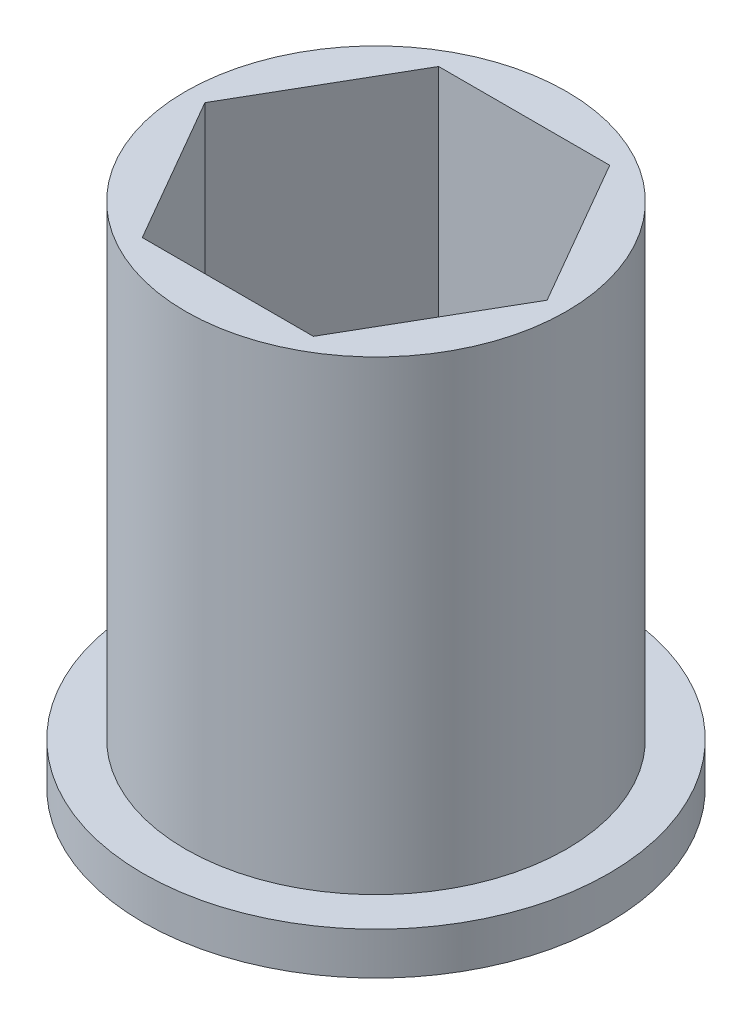
ISO-10303-21;
HEADER;
FILE_DESCRIPTION(('STEP AP214'),'2;1');
FILE_NAME('part.step','',(''),(''),'','','');
FILE_SCHEMA(('AUTOMOTIVE_DESIGN { 1 0 10303 214 1 1 1 1 }'));
ENDSEC;
DATA;
#1=APPLICATION_CONTEXT('core data for automotive mechanical design processes');
#2=APPLICATION_PROTOCOL_DEFINITION('international standard','automotive_design',2000,#1);
#3=PRODUCT_CONTEXT('',#1,'mechanical');
#4=PRODUCT('Part','Part','',(#3));
#5=PRODUCT_RELATED_PRODUCT_CATEGORY('part','',(#4));
#6=PRODUCT_DEFINITION_FORMATION('','',#4);
#7=PRODUCT_DEFINITION_CONTEXT('part definition',#1,'design');
#8=PRODUCT_DEFINITION('design','',#6,#7);
#9=PRODUCT_DEFINITION_SHAPE('','',#8);
#10=(LENGTH_UNIT() NAMED_UNIT(*) SI_UNIT(.MILLI.,.METRE.));
#11=(NAMED_UNIT(*) PLANE_ANGLE_UNIT() SI_UNIT($,.RADIAN.));
#12=(NAMED_UNIT(*) SI_UNIT($,.STERADIAN.) SOLID_ANGLE_UNIT());
#13=UNCERTAINTY_MEASURE_WITH_UNIT(LENGTH_MEASURE(1.E-05),#10,'distance_accuracy_value','');
#14=(GEOMETRIC_REPRESENTATION_CONTEXT(3) GLOBAL_UNCERTAINTY_ASSIGNED_CONTEXT((#13)) GLOBAL_UNIT_ASSIGNED_CONTEXT((#10,
#11,#12)) REPRESENTATION_CONTEXT('',''));
#15=CARTESIAN_POINT('',(0.,0.,0.));
#16=DIRECTION('',(0.,0.,1.));
#17=DIRECTION('',(1.,0.,0.));
#18=AXIS2_PLACEMENT_3D('',#15,#16,#17);
#19=CARTESIAN_POINT('',(0.,12.,0.));
#20=DIRECTION('',(0.,-1.,0.));
#21=DIRECTION('',(0.,0.,-1.));
#22=AXIS2_PLACEMENT_3D('',#19,#20,#21);
#23=CYLINDRICAL_SURFACE('',#22,4.5);
#24=CARTESIAN_POINT('',(0.,12.,0.));
#25=DIRECTION('',(0.,1.,0.));
#26=DIRECTION('',(0.,0.,1.));
#27=AXIS2_PLACEMENT_3D('',#24,#25,#26);
#28=CIRCLE('',#27,4.5);
#29=CARTESIAN_POINT('',(0.,12.,4.5));
#30=VERTEX_POINT('',#29);
#31=EDGE_CURVE('E49',#30,#30,#28,.T.);
#32=ORIENTED_EDGE('',*,*,#31,.F.);
#33=EDGE_LOOP('',(#32));
#34=FACE_BOUND('',#33,.T.);
#35=CARTESIAN_POINT('',(0.,1.,0.));
#36=DIRECTION('',(0.,-1.,0.));
#37=DIRECTION('',(0.,0.,-1.));
#38=AXIS2_PLACEMENT_3D('',#35,#36,#37);
#39=CIRCLE('',#38,4.5);
#40=CARTESIAN_POINT('',(0.,1.,-4.5));
#41=VERTEX_POINT('',#40);
#42=EDGE_CURVE('E11',#41,#41,#39,.T.);
#43=ORIENTED_EDGE('',*,*,#42,.F.);
#44=EDGE_LOOP('',(#43));
#45=FACE_BOUND('',#44,.T.);
#46=ADVANCED_FACE('F42',(#34,#45),#23,.T.);
#47=CARTESIAN_POINT('',(0.,12.,0.));
#48=DIRECTION('',(0.,1.,0.));
#49=DIRECTION('',(0.,0.,1.));
#50=AXIS2_PLACEMENT_3D('',#47,#48,#49);
#51=PLANE('',#50);
#52=ORIENTED_EDGE('',*,*,#31,.T.);
#53=EDGE_LOOP('',(#52));
#54=FACE_BOUND('',#53,.T.);
#55=DIRECTION('',(-0.5,0.,-0.866025403784439));
#56=VECTOR('',#55,1.);
#57=CARTESIAN_POINT('',(4.04145188432738,12.,0.));
#58=LINE('',#57,#56);
#59=CARTESIAN_POINT('',(4.04145188432738,12.,0.));
#60=VERTEX_POINT('',#59);
#61=CARTESIAN_POINT('',(2.02072594216369,12.,-3.5));
#62=VERTEX_POINT('',#61);
#63=EDGE_CURVE('E102',#60,#62,#58,.T.);
#64=ORIENTED_EDGE('',*,*,#63,.F.);
#65=DIRECTION('',(0.5,0.,-0.866025403784439));
#66=VECTOR('',#65,1.);
#67=CARTESIAN_POINT('',(2.02072594216369,12.,3.5));
#68=LINE('',#67,#66);
#69=CARTESIAN_POINT('',(2.02072594216369,12.,3.5));
#70=VERTEX_POINT('',#69);
#71=EDGE_CURVE('E94',#70,#60,#68,.T.);
#72=ORIENTED_EDGE('',*,*,#71,.F.);
#73=DIRECTION('',(1.,0.,0.));
#74=VECTOR('',#73,1.);
#75=CARTESIAN_POINT('',(-2.02072594216369,12.,3.5));
#76=LINE('',#75,#74);
#77=CARTESIAN_POINT('',(-2.02072594216369,12.,3.5));
#78=VERTEX_POINT('',#77);
#79=EDGE_CURVE('E124',#78,#70,#76,.T.);
#80=ORIENTED_EDGE('',*,*,#79,.F.);
#81=DIRECTION('',(0.5,0.,0.866025403784439));
#82=VECTOR('',#81,1.);
#83=CARTESIAN_POINT('',(-4.04145188432738,12.,0.));
#84=LINE('',#83,#82);
#85=CARTESIAN_POINT('',(-4.04145188432738,12.,0.));
#86=VERTEX_POINT('',#85);
#87=EDGE_CURVE('E122',#86,#78,#84,.T.);
#88=ORIENTED_EDGE('',*,*,#87,.F.);
#89=DIRECTION('',(-0.5,0.,0.866025403784439));
#90=VECTOR('',#89,1.);
#91=CARTESIAN_POINT('',(-2.02072594216369,12.,-3.5));
#92=LINE('',#91,#90);
#93=CARTESIAN_POINT('',(-2.02072594216369,12.,-3.5));
#94=VERTEX_POINT('',#93);
#95=EDGE_CURVE('E117',#94,#86,#92,.T.);
#96=ORIENTED_EDGE('',*,*,#95,.F.);
#97=DIRECTION('',(-1.,0.,0.));
#98=VECTOR('',#97,1.);
#99=CARTESIAN_POINT('',(2.02072594216369,12.,-3.5));
#100=LINE('',#99,#98);
#101=EDGE_CURVE('E115',#62,#94,#100,.T.);
#102=ORIENTED_EDGE('',*,*,#101,.F.);
#103=EDGE_LOOP('',(#64,#72,#80,#88,#96,#102));
#104=FACE_BOUND('',#103,.T.);
#105=ADVANCED_FACE('F113',(#54,#104),#51,.T.);
#106=CARTESIAN_POINT('',(0.,0.,0.));
#107=DIRECTION('',(0.,1.,0.));
#108=DIRECTION('',(0.,0.,1.));
#109=AXIS2_PLACEMENT_3D('',#106,#107,#108);
#110=PLANE('',#109);
#111=DIRECTION('',(0.5,0.,-0.866025403784439));
#112=VECTOR('',#111,1.);
#113=CARTESIAN_POINT('',(2.02072594216369,0.,3.5));
#114=LINE('',#113,#112);
#115=CARTESIAN_POINT('',(2.02072594216369,0.,3.5));
#116=VERTEX_POINT('',#115);
#117=CARTESIAN_POINT('',(4.04145188432738,0.,0.));
#118=VERTEX_POINT('',#117);
#119=EDGE_CURVE('E64',#116,#118,#114,.T.);
#120=ORIENTED_EDGE('',*,*,#119,.T.);
#121=DIRECTION('',(-0.5,0.,-0.866025403784439));
#122=VECTOR('',#121,1.);
#123=CARTESIAN_POINT('',(4.04145188432738,0.,0.));
#124=LINE('',#123,#122);
#125=CARTESIAN_POINT('',(2.02072594216369,0.,-3.5));
#126=VERTEX_POINT('',#125);
#127=EDGE_CURVE('E109',#118,#126,#124,.T.);
#128=ORIENTED_EDGE('',*,*,#127,.T.);
#129=DIRECTION('',(-1.,0.,0.));
#130=VECTOR('',#129,1.);
#131=CARTESIAN_POINT('',(2.02072594216369,0.,-3.5));
#132=LINE('',#131,#130);
#133=CARTESIAN_POINT('',(-2.02072594216369,0.,-3.5));
#134=VERTEX_POINT('',#133);
#135=EDGE_CURVE('E129',#126,#134,#132,.T.);
#136=ORIENTED_EDGE('',*,*,#135,.T.);
#137=DIRECTION('',(-0.5,0.,0.866025403784439));
#138=VECTOR('',#137,1.);
#139=CARTESIAN_POINT('',(-2.02072594216369,0.,-3.5));
#140=LINE('',#139,#138);
#141=CARTESIAN_POINT('',(-4.04145188432738,0.,0.));
#142=VERTEX_POINT('',#141);
#143=EDGE_CURVE('E132',#134,#142,#140,.T.);
#144=ORIENTED_EDGE('',*,*,#143,.T.);
#145=DIRECTION('',(0.5,0.,0.866025403784439));
#146=VECTOR('',#145,1.);
#147=CARTESIAN_POINT('',(-4.04145188432738,0.,0.));
#148=LINE('',#147,#146);
#149=CARTESIAN_POINT('',(-2.02072594216369,0.,3.5));
#150=VERTEX_POINT('',#149);
#151=EDGE_CURVE('E135',#142,#150,#148,.T.);
#152=ORIENTED_EDGE('',*,*,#151,.T.);
#153=DIRECTION('',(1.,0.,0.));
#154=VECTOR('',#153,1.);
#155=CARTESIAN_POINT('',(-2.02072594216369,0.,3.5));
#156=LINE('',#155,#154);
#157=EDGE_CURVE('E103',#150,#116,#156,.T.);
#158=ORIENTED_EDGE('',*,*,#157,.T.);
#159=EDGE_LOOP('',(#120,#128,#136,#144,#152,#158));
#160=FACE_BOUND('',#159,.T.);
#161=CARTESIAN_POINT('',(0.,0.,0.));
#162=DIRECTION('',(0.,-1.,0.));
#163=DIRECTION('',(0.,0.,-1.));
#164=AXIS2_PLACEMENT_3D('',#161,#162,#163);
#165=CIRCLE('',#164,5.5);
#166=CARTESIAN_POINT('',(0.,0.,-5.5));
#167=VERTEX_POINT('',#166);
#168=EDGE_CURVE('E162',#167,#167,#165,.T.);
#169=ORIENTED_EDGE('',*,*,#168,.T.);
#170=EDGE_LOOP('',(#169));
#171=FACE_BOUND('',#170,.T.);
#172=ADVANCED_FACE('F167',(#160,#171),#110,.F.);
#173=CARTESIAN_POINT('',(2.02072594216369,12.,3.5));
#174=DIRECTION('',(-0.866025403784439,0.,-0.5));
#175=DIRECTION('',(-0.5,0.,0.866025403784439));
#176=AXIS2_PLACEMENT_3D('',#173,#174,#175);
#177=PLANE('',#176);
#178=ORIENTED_EDGE('',*,*,#119,.F.);
#179=DIRECTION('',(0.,-1.,0.));
#180=VECTOR('',#179,1.);
#181=CARTESIAN_POINT('',(2.02072594216369,12.,3.5));
#182=LINE('',#181,#180);
#183=EDGE_CURVE('E98',#70,#116,#182,.T.);
#184=ORIENTED_EDGE('',*,*,#183,.F.);
#185=ORIENTED_EDGE('',*,*,#71,.T.);
#186=DIRECTION('',(0.,-1.,0.));
#187=VECTOR('',#186,1.);
#188=CARTESIAN_POINT('',(4.04145188432738,12.,0.));
#189=LINE('',#188,#187);
#190=EDGE_CURVE('E97',#60,#118,#189,.T.);
#191=ORIENTED_EDGE('',*,*,#190,.T.);
#192=EDGE_LOOP('',(#178,#184,#185,#191));
#193=FACE_BOUND('',#192,.T.);
#194=ADVANCED_FACE('F96',(#193),#177,.T.);
#195=CARTESIAN_POINT('',(4.04145188432738,12.,0.));
#196=DIRECTION('',(-0.866025403784438,0.,0.5));
#197=DIRECTION('',(0.5,0.,0.866025403784439));
#198=AXIS2_PLACEMENT_3D('',#195,#196,#197);
#199=PLANE('',#198);
#200=ORIENTED_EDGE('',*,*,#127,.F.);
#201=ORIENTED_EDGE('',*,*,#190,.F.);
#202=ORIENTED_EDGE('',*,*,#63,.T.);
#203=DIRECTION('',(0.,-1.,0.));
#204=VECTOR('',#203,1.);
#205=CARTESIAN_POINT('',(2.02072594216369,12.,-3.5));
#206=LINE('',#205,#204);
#207=EDGE_CURVE('E110',#62,#126,#206,.T.);
#208=ORIENTED_EDGE('',*,*,#207,.T.);
#209=EDGE_LOOP('',(#200,#201,#202,#208));
#210=FACE_BOUND('',#209,.T.);
#211=ADVANCED_FACE('F106',(#210),#199,.T.);
#212=CARTESIAN_POINT('',(2.02072594216369,12.,-3.5));
#213=DIRECTION('',(0.,0.,1.));
#214=DIRECTION('',(1.,0.,0.));
#215=AXIS2_PLACEMENT_3D('',#212,#213,#214);
#216=PLANE('',#215);
#217=ORIENTED_EDGE('',*,*,#135,.F.);
#218=ORIENTED_EDGE('',*,*,#207,.F.);
#219=ORIENTED_EDGE('',*,*,#101,.T.);
#220=DIRECTION('',(0.,-1.,0.));
#221=VECTOR('',#220,1.);
#222=CARTESIAN_POINT('',(-2.02072594216369,12.,-3.5));
#223=LINE('',#222,#221);
#224=EDGE_CURVE('E144',#94,#134,#223,.T.);
#225=ORIENTED_EDGE('',*,*,#224,.T.);
#226=EDGE_LOOP('',(#217,#218,#219,#225));
#227=FACE_BOUND('',#226,.T.);
#228=ADVANCED_FACE('F185',(#227),#216,.T.);
#229=CARTESIAN_POINT('',(-2.02072594216369,12.,-3.5));
#230=DIRECTION('',(0.866025403784439,0.,0.5));
#231=DIRECTION('',(0.5,0.,-0.866025403784439));
#232=AXIS2_PLACEMENT_3D('',#229,#230,#231);
#233=PLANE('',#232);
#234=ORIENTED_EDGE('',*,*,#143,.F.);
#235=ORIENTED_EDGE('',*,*,#224,.F.);
#236=ORIENTED_EDGE('',*,*,#95,.T.);
#237=DIRECTION('',(0.,-1.,0.));
#238=VECTOR('',#237,1.);
#239=CARTESIAN_POINT('',(-4.04145188432738,12.,0.));
#240=LINE('',#239,#238);
#241=EDGE_CURVE('E142',#86,#142,#240,.T.);
#242=ORIENTED_EDGE('',*,*,#241,.T.);
#243=EDGE_LOOP('',(#234,#235,#236,#242));
#244=FACE_BOUND('',#243,.T.);
#245=ADVANCED_FACE('F181',(#244),#233,.T.);
#246=CARTESIAN_POINT('',(-4.04145188432738,12.,0.));
#247=DIRECTION('',(0.866025403784439,0.,-0.5));
#248=DIRECTION('',(-0.5,0.,-0.866025403784439));
#249=AXIS2_PLACEMENT_3D('',#246,#247,#248);
#250=PLANE('',#249);
#251=ORIENTED_EDGE('',*,*,#151,.F.);
#252=ORIENTED_EDGE('',*,*,#241,.F.);
#253=ORIENTED_EDGE('',*,*,#87,.T.);
#254=DIRECTION('',(0.,-1.,0.));
#255=VECTOR('',#254,1.);
#256=CARTESIAN_POINT('',(-2.02072594216369,12.,3.5));
#257=LINE('',#256,#255);
#258=EDGE_CURVE('E56',#78,#150,#257,.T.);
#259=ORIENTED_EDGE('',*,*,#258,.T.);
#260=EDGE_LOOP('',(#251,#252,#253,#259));
#261=FACE_BOUND('',#260,.T.);
#262=ADVANCED_FACE('F176',(#261),#250,.T.);
#263=CARTESIAN_POINT('',(-2.02072594216369,12.,3.5));
#264=DIRECTION('',(0.,0.,-1.));
#265=DIRECTION('',(-1.,0.,0.));
#266=AXIS2_PLACEMENT_3D('',#263,#264,#265);
#267=PLANE('',#266);
#268=ORIENTED_EDGE('',*,*,#157,.F.);
#269=ORIENTED_EDGE('',*,*,#258,.F.);
#270=ORIENTED_EDGE('',*,*,#79,.T.);
#271=ORIENTED_EDGE('',*,*,#183,.T.);
#272=EDGE_LOOP('',(#268,#269,#270,#271));
#273=FACE_BOUND('',#272,.T.);
#274=ADVANCED_FACE('F170',(#273),#267,.T.);
#275=CARTESIAN_POINT('',(0.,1.,0.));
#276=DIRECTION('',(0.,-1.,0.));
#277=DIRECTION('',(0.,0.,-1.));
#278=AXIS2_PLACEMENT_3D('',#275,#276,#277);
#279=CYLINDRICAL_SURFACE('',#278,5.5);
#280=CARTESIAN_POINT('',(0.,1.,0.));
#281=DIRECTION('',(0.,-1.,0.));
#282=DIRECTION('',(0.,0.,-1.));
#283=AXIS2_PLACEMENT_3D('',#280,#281,#282);
#284=CIRCLE('',#283,5.5);
#285=CARTESIAN_POINT('',(0.,1.,-5.5));
#286=VERTEX_POINT('',#285);
#287=EDGE_CURVE('E127',#286,#286,#284,.T.);
#288=ORIENTED_EDGE('',*,*,#287,.T.);
#289=EDGE_LOOP('',(#288));
#290=FACE_BOUND('',#289,.T.);
#291=ORIENTED_EDGE('',*,*,#168,.F.);
#292=EDGE_LOOP('',(#291));
#293=FACE_BOUND('',#292,.T.);
#294=ADVANCED_FACE('F157',(#290,#293),#279,.T.);
#295=CARTESIAN_POINT('',(0.,1.,0.));
#296=DIRECTION('',(0.,-1.,0.));
#297=DIRECTION('',(0.,0.,-1.));
#298=AXIS2_PLACEMENT_3D('',#295,#296,#297);
#299=PLANE('',#298);
#300=ORIENTED_EDGE('',*,*,#42,.T.);
#301=EDGE_LOOP('',(#300));
#302=FACE_BOUND('',#301,.T.);
#303=ORIENTED_EDGE('',*,*,#287,.F.);
#304=EDGE_LOOP('',(#303));
#305=FACE_BOUND('',#304,.T.);
#306=ADVANCED_FACE('F154',(#302,#305),#299,.F.);
#307=CLOSED_SHELL('',(#46,#105,#172,#194,#211,#228,#245,#262,#274,#294,#306));
#308=MANIFOLD_SOLID_BREP('B2',#307);
#309=ADVANCED_BREP_SHAPE_REPRESENTATION('',(#18,#308),#14);
#310=SHAPE_DEFINITION_REPRESENTATION(#9,#309);
ENDSEC;
END-ISO-10303-21;
